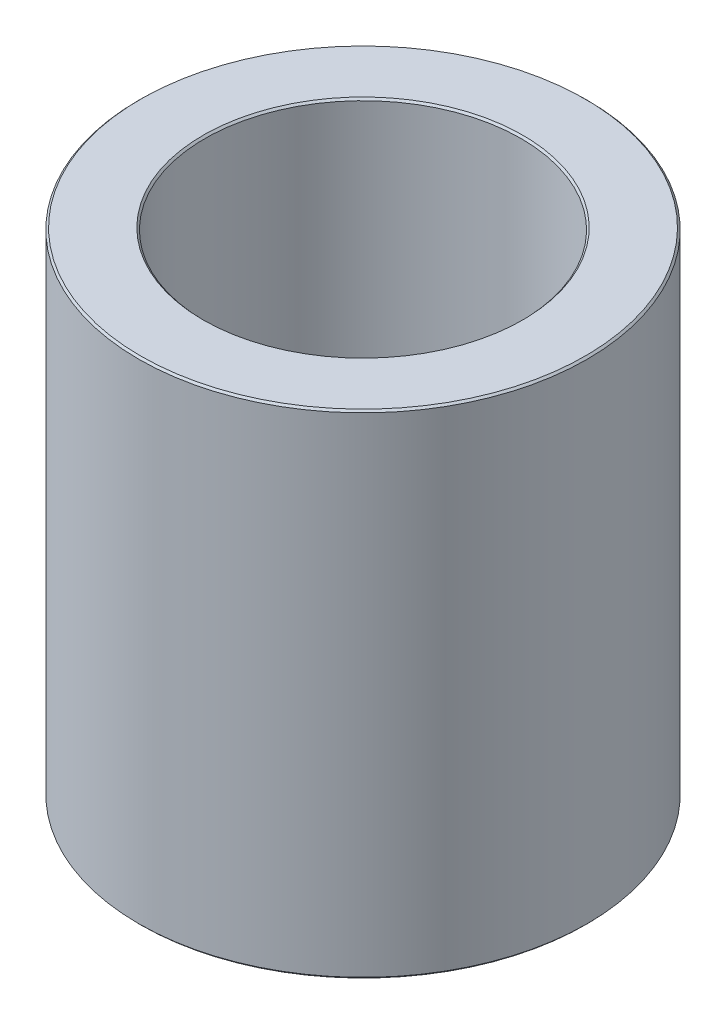
ISO-10303-21;
HEADER;
FILE_DESCRIPTION(('STEP AP214'),'2;1');
FILE_NAME('part.step','',(''),(''),'','','');
FILE_SCHEMA(('AUTOMOTIVE_DESIGN { 1 0 10303 214 1 1 1 1 }'));
ENDSEC;
DATA;
#1=APPLICATION_CONTEXT('core data for automotive mechanical design processes');
#2=APPLICATION_PROTOCOL_DEFINITION('international standard','automotive_design',2000,#1);
#3=PRODUCT_CONTEXT('',#1,'mechanical');
#4=PRODUCT('Part','Part','',(#3));
#5=PRODUCT_RELATED_PRODUCT_CATEGORY('part','',(#4));
#6=PRODUCT_DEFINITION_FORMATION('','',#4);
#7=PRODUCT_DEFINITION_CONTEXT('part definition',#1,'design');
#8=PRODUCT_DEFINITION('design','',#6,#7);
#9=PRODUCT_DEFINITION_SHAPE('','',#8);
#10=(LENGTH_UNIT() NAMED_UNIT(*) SI_UNIT(.MILLI.,.METRE.));
#11=(NAMED_UNIT(*) PLANE_ANGLE_UNIT() SI_UNIT($,.RADIAN.));
#12=(NAMED_UNIT(*) SI_UNIT($,.STERADIAN.) SOLID_ANGLE_UNIT());
#13=UNCERTAINTY_MEASURE_WITH_UNIT(LENGTH_MEASURE(1.E-05),#10,'distance_accuracy_value','');
#14=(GEOMETRIC_REPRESENTATION_CONTEXT(3) GLOBAL_UNCERTAINTY_ASSIGNED_CONTEXT((#13)) GLOBAL_UNIT_ASSIGNED_CONTEXT((#10,
#11,#12)) REPRESENTATION_CONTEXT('',''));
#15=CARTESIAN_POINT('',(0.,0.,0.));
#16=DIRECTION('',(0.,0.,1.));
#17=DIRECTION('',(1.,0.,0.));
#18=AXIS2_PLACEMENT_3D('',#15,#16,#17);
#19=CARTESIAN_POINT('',(0.,115.308149564449,0.));
#20=DIRECTION('',(0.,-1.,0.));
#21=DIRECTION('',(0.,0.,-1.));
#22=AXIS2_PLACEMENT_3D('',#19,#20,#21);
#23=CYLINDRICAL_SURFACE('',#22,52.5);
#24=CARTESIAN_POINT('',(0.,0.448155147295709,0.));
#25=DIRECTION('',(0.,1.,0.));
#26=DIRECTION('',(0.,0.,1.));
#27=AXIS2_PLACEMENT_3D('',#24,#25,#26);
#28=CIRCLE('',#27,52.5);
#29=CARTESIAN_POINT('',(0.,0.448155147295709,52.5));
#30=VERTEX_POINT('',#29);
#31=EDGE_CURVE('E10',#30,#30,#28,.T.);
#32=ORIENTED_EDGE('',*,*,#31,.T.);
#33=EDGE_LOOP('',(#32));
#34=FACE_BOUND('',#33,.T.);
#35=CARTESIAN_POINT('',(0.,114.878010349197,0.));
#36=DIRECTION('',(0.,1.,0.));
#37=DIRECTION('',(0.,0.,1.));
#38=AXIS2_PLACEMENT_3D('',#35,#36,#37);
#39=CIRCLE('',#38,52.5);
#40=CARTESIAN_POINT('',(0.,114.878010349197,52.5));
#41=VERTEX_POINT('',#40);
#42=EDGE_CURVE('E50',#41,#41,#39,.F.);
#43=ORIENTED_EDGE('',*,*,#42,.T.);
#44=EDGE_LOOP('',(#43));
#45=FACE_BOUND('',#44,.T.);
#46=ADVANCED_FACE('F39',(#34,#45),#23,.T.);
#47=CARTESIAN_POINT('',(0.,115.308149564449,0.));
#48=DIRECTION('',(0.,1.,0.));
#49=DIRECTION('',(0.,0.,1.));
#50=AXIS2_PLACEMENT_3D('',#47,#48,#49);
#51=PLANE('',#50);
#52=CARTESIAN_POINT('',(0.,115.308149564449,0.));
#53=DIRECTION('',(0.,1.,0.));
#54=DIRECTION('',(0.,0.,1.));
#55=AXIS2_PLACEMENT_3D('',#52,#53,#54);
#56=CIRCLE('',#55,37.4362753811326);
#57=CARTESIAN_POINT('',(0.,115.308149564449,37.4362753811326));
#58=VERTEX_POINT('',#57);
#59=EDGE_CURVE('E58',#58,#58,#56,.F.);
#60=ORIENTED_EDGE('',*,*,#59,.T.);
#61=EDGE_LOOP('',(#60));
#62=FACE_BOUND('',#61,.T.);
#63=CARTESIAN_POINT('',(0.,115.308149564449,0.));
#64=DIRECTION('',(0.,1.,0.));
#65=DIRECTION('',(0.,0.,1.));
#66=AXIS2_PLACEMENT_3D('',#63,#64,#65);
#67=CIRCLE('',#66,52.0518448527043);
#68=CARTESIAN_POINT('',(0.,115.308149564449,52.0518448527043));
#69=VERTEX_POINT('',#68);
#70=EDGE_CURVE('E61',#69,#69,#67,.T.);
#71=ORIENTED_EDGE('',*,*,#70,.T.);
#72=EDGE_LOOP('',(#71));
#73=FACE_BOUND('',#72,.T.);
#74=ADVANCED_FACE('F88',(#62,#73),#51,.T.);
#75=CARTESIAN_POINT('',(0.,0.,0.));
#76=DIRECTION('',(0.,1.,0.));
#77=DIRECTION('',(0.,0.,1.));
#78=AXIS2_PLACEMENT_3D('',#75,#76,#77);
#79=PLANE('',#78);
#80=CARTESIAN_POINT('',(0.,0.,0.));
#81=DIRECTION('',(0.,1.,0.));
#82=DIRECTION('',(0.,0.,1.));
#83=AXIS2_PLACEMENT_3D('',#80,#81,#82);
#84=CIRCLE('',#83,37.4542913131758);
#85=CARTESIAN_POINT('',(0.,0.,37.4542913131758));
#86=VERTEX_POINT('',#85);
#87=EDGE_CURVE('E51',#86,#86,#84,.T.);
#88=ORIENTED_EDGE('',*,*,#87,.T.);
#89=EDGE_LOOP('',(#88));
#90=FACE_BOUND('',#89,.T.);
#91=CARTESIAN_POINT('',(0.,0.,0.));
#92=DIRECTION('',(0.,1.,0.));
#93=DIRECTION('',(0.,0.,1.));
#94=AXIS2_PLACEMENT_3D('',#91,#92,#93);
#95=CIRCLE('',#94,52.0698607847476);
#96=CARTESIAN_POINT('',(0.,0.,52.0698607847476));
#97=VERTEX_POINT('',#96);
#98=EDGE_CURVE('E54',#97,#97,#95,.F.);
#99=ORIENTED_EDGE('',*,*,#98,.T.);
#100=EDGE_LOOP('',(#99));
#101=FACE_BOUND('',#100,.T.);
#102=ADVANCED_FACE('F83',(#90,#101),#79,.F.);
#103=CARTESIAN_POINT('',(0.,115.308149564449,0.));
#104=DIRECTION('',(0.,-1.,0.));
#105=DIRECTION('',(0.,0.,-1.));
#106=AXIS2_PLACEMENT_3D('',#103,#104,#105);
#107=CYLINDRICAL_SURFACE('',#106,37.0061361658802);
#108=CARTESIAN_POINT('',(0.,114.859994417153,0.));
#109=DIRECTION('',(0.,1.,0.));
#110=DIRECTION('',(0.,0.,1.));
#111=AXIS2_PLACEMENT_3D('',#108,#109,#110);
#112=CIRCLE('',#111,37.0061361658802);
#113=CARTESIAN_POINT('',(0.,114.859994417153,37.0061361658802));
#114=VERTEX_POINT('',#113);
#115=EDGE_CURVE('E67',#114,#114,#112,.T.);
#116=ORIENTED_EDGE('',*,*,#115,.T.);
#117=EDGE_LOOP('',(#116));
#118=FACE_BOUND('',#117,.T.);
#119=CARTESIAN_POINT('',(0.,0.430139215252368,0.));
#120=DIRECTION('',(0.,1.,0.));
#121=DIRECTION('',(0.,0.,1.));
#122=AXIS2_PLACEMENT_3D('',#119,#120,#121);
#123=CIRCLE('',#122,37.0061361658802);
#124=CARTESIAN_POINT('',(0.,0.430139215252368,37.0061361658802));
#125=VERTEX_POINT('',#124);
#126=EDGE_CURVE('E69',#125,#125,#123,.F.);
#127=ORIENTED_EDGE('',*,*,#126,.T.);
#128=EDGE_LOOP('',(#127));
#129=FACE_BOUND('',#128,.T.);
#130=ADVANCED_FACE('F71',(#118,#129),#107,.F.);
#131=CARTESIAN_POINT('',(0.,114.859994417153,0.));
#132=DIRECTION('',(0.,1.,0.));
#133=DIRECTION('',(0.,0.,1.));
#134=AXIS2_PLACEMENT_3D('',#131,#132,#133);
#135=CONICAL_SURFACE('',#134,37.0061361658802,0.76488863189935);
#136=ORIENTED_EDGE('',*,*,#59,.F.);
#137=EDGE_LOOP('',(#136));
#138=FACE_BOUND('',#137,.T.);
#139=ORIENTED_EDGE('',*,*,#115,.F.);
#140=EDGE_LOOP('',(#139));
#141=FACE_BOUND('',#140,.T.);
#142=ADVANCED_FACE('F77',(#138,#141),#135,.F.);
#143=CARTESIAN_POINT('',(0.,0.,0.));
#144=DIRECTION('',(0.,-1.,0.));
#145=DIRECTION('',(0.,0.,-1.));
#146=AXIS2_PLACEMENT_3D('',#143,#144,#145);
#147=CONICAL_SURFACE('',#146,37.4542913131758,0.805907694895564);
#148=ORIENTED_EDGE('',*,*,#126,.F.);
#149=EDGE_LOOP('',(#148));
#150=FACE_BOUND('',#149,.T.);
#151=ORIENTED_EDGE('',*,*,#87,.F.);
#152=EDGE_LOOP('',(#151));
#153=FACE_BOUND('',#152,.T.);
#154=ADVANCED_FACE('F73',(#150,#153),#147,.F.);
#155=CARTESIAN_POINT('',(0.,0.448155147295709,0.));
#156=DIRECTION('',(0.,1.,0.));
#157=DIRECTION('',(0.,0.,1.));
#158=AXIS2_PLACEMENT_3D('',#155,#156,#157);
#159=CONICAL_SURFACE('',#158,52.5,0.76488863189935);
#160=ORIENTED_EDGE('',*,*,#98,.F.);
#161=EDGE_LOOP('',(#160));
#162=FACE_BOUND('',#161,.T.);
#163=ORIENTED_EDGE('',*,*,#31,.F.);
#164=EDGE_LOOP('',(#163));
#165=FACE_BOUND('',#164,.T.);
#166=ADVANCED_FACE('F76',(#162,#165),#159,.T.);
#167=CARTESIAN_POINT('',(0.,115.308149564449,0.));
#168=DIRECTION('',(0.,-1.,0.));
#169=DIRECTION('',(0.,0.,-1.));
#170=AXIS2_PLACEMENT_3D('',#167,#168,#169);
#171=CONICAL_SURFACE('',#170,52.0518448527043,0.805907694895561);
#172=ORIENTED_EDGE('',*,*,#42,.F.);
#173=EDGE_LOOP('',(#172));
#174=FACE_BOUND('',#173,.T.);
#175=ORIENTED_EDGE('',*,*,#70,.F.);
#176=EDGE_LOOP('',(#175));
#177=FACE_BOUND('',#176,.T.);
#178=ADVANCED_FACE('F45',(#174,#177),#171,.T.);
#179=CLOSED_SHELL('',(#46,#74,#102,#130,#142,#154,#166,#178));
#180=MANIFOLD_SOLID_BREP('B2',#179);
#181=ADVANCED_BREP_SHAPE_REPRESENTATION('',(#18,#180),#14);
#182=SHAPE_DEFINITION_REPRESENTATION(#9,#181);
ENDSEC;
END-ISO-10303-21;
